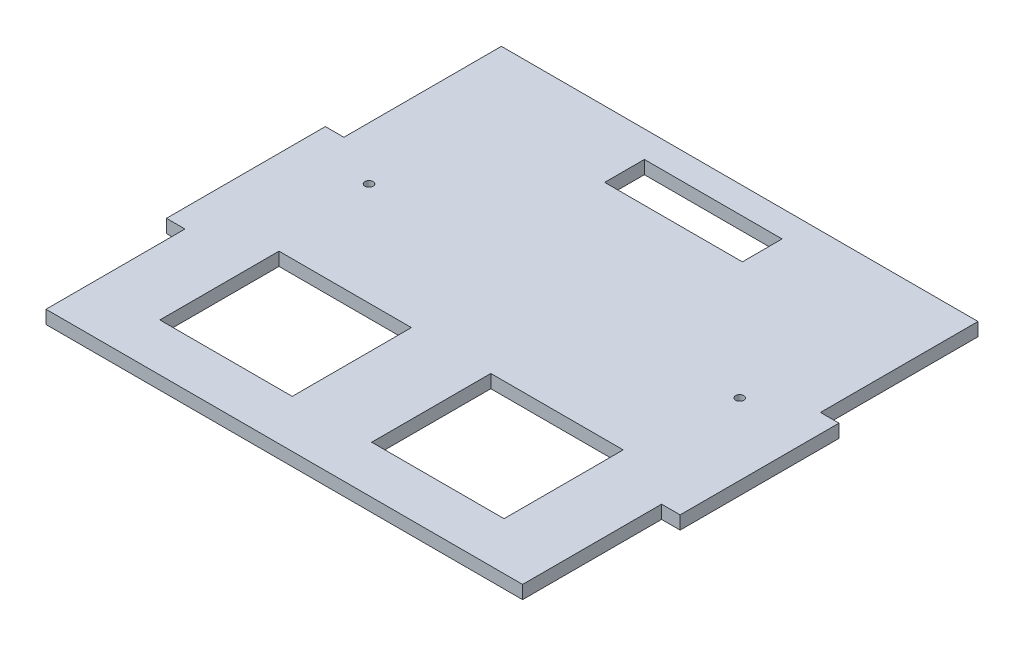
ISO-10303-21;
HEADER;
FILE_DESCRIPTION(('STEP AP214'),'2;1');
FILE_NAME('part.step','',(''),(''),'','','');
FILE_SCHEMA(('AUTOMOTIVE_DESIGN { 1 0 10303 214 1 1 1 1 }'));
ENDSEC;
DATA;
#1=APPLICATION_CONTEXT('core data for automotive mechanical design processes');
#2=APPLICATION_PROTOCOL_DEFINITION('international standard','automotive_design',2000,#1);
#3=PRODUCT_CONTEXT('',#1,'mechanical');
#4=PRODUCT('Part','Part','',(#3));
#5=PRODUCT_RELATED_PRODUCT_CATEGORY('part','',(#4));
#6=PRODUCT_DEFINITION_FORMATION('','',#4);
#7=PRODUCT_DEFINITION_CONTEXT('part definition',#1,'design');
#8=PRODUCT_DEFINITION('design','',#6,#7);
#9=PRODUCT_DEFINITION_SHAPE('','',#8);
#10=(LENGTH_UNIT() NAMED_UNIT(*) SI_UNIT(.MILLI.,.METRE.));
#11=(NAMED_UNIT(*) PLANE_ANGLE_UNIT() SI_UNIT($,.RADIAN.));
#12=(NAMED_UNIT(*) SI_UNIT($,.STERADIAN.) SOLID_ANGLE_UNIT());
#13=UNCERTAINTY_MEASURE_WITH_UNIT(LENGTH_MEASURE(1.E-05),#10,'distance_accuracy_value','');
#14=(GEOMETRIC_REPRESENTATION_CONTEXT(3) GLOBAL_UNCERTAINTY_ASSIGNED_CONTEXT((#13)) GLOBAL_UNIT_ASSIGNED_CONTEXT((#10,
#11,#12)) REPRESENTATION_CONTEXT('',''));
#15=CARTESIAN_POINT('',(0.,0.,0.));
#16=DIRECTION('',(0.,0.,1.));
#17=DIRECTION('',(1.,0.,0.));
#18=AXIS2_PLACEMENT_3D('',#15,#16,#17);
#19=CARTESIAN_POINT('',(0.,5.,0.));
#20=DIRECTION('',(0.,1.,0.));
#21=DIRECTION('',(0.,0.,1.));
#22=AXIS2_PLACEMENT_3D('',#19,#20,#21);
#23=PLANE('',#22);
#24=DIRECTION('',(1.,0.,0.));
#25=VECTOR('',#24,1.);
#26=CARTESIAN_POINT('',(15.,5.,64.5));
#27=LINE('',#26,#25);
#28=CARTESIAN_POINT('',(15.,5.,64.5));
#29=VERTEX_POINT('',#28);
#30=CARTESIAN_POINT('',(65.,5.,64.5));
#31=VERTEX_POINT('',#30);
#32=EDGE_CURVE('E206',#29,#31,#27,.T.);
#33=ORIENTED_EDGE('',*,*,#32,.F.);
#34=DIRECTION('',(0.,0.,1.));
#35=VECTOR('',#34,1.);
#36=CARTESIAN_POINT('',(15.,5.,64.5));
#37=LINE('',#36,#35);
#38=CARTESIAN_POINT('',(15.,5.,19.5));
#39=VERTEX_POINT('',#38);
#40=EDGE_CURVE('E198',#39,#29,#37,.T.);
#41=ORIENTED_EDGE('',*,*,#40,.F.);
#42=DIRECTION('',(-1.,0.,0.));
#43=VECTOR('',#42,1.);
#44=CARTESIAN_POINT('',(15.,5.,19.5));
#45=LINE('',#44,#43);
#46=CARTESIAN_POINT('',(65.,5.,19.5));
#47=VERTEX_POINT('',#46);
#48=EDGE_CURVE('E221',#47,#39,#45,.T.);
#49=ORIENTED_EDGE('',*,*,#48,.F.);
#50=DIRECTION('',(0.,0.,-1.));
#51=VECTOR('',#50,1.);
#52=CARTESIAN_POINT('',(65.,5.,64.5));
#53=LINE('',#52,#51);
#54=EDGE_CURVE('E219',#31,#47,#53,.T.);
#55=ORIENTED_EDGE('',*,*,#54,.F.);
#56=EDGE_LOOP('',(#33,#41,#49,#55));
#57=FACE_BOUND('',#56,.T.);
#58=CARTESIAN_POINT('',(70.,5.,-19.5));
#59=DIRECTION('',(0.,1.,0.));
#60=DIRECTION('',(0.,0.,1.));
#61=AXIS2_PLACEMENT_3D('',#58,#59,#60);
#62=CIRCLE('',#61,1.54999999999999);
#63=CARTESIAN_POINT('',(70.,5.,-17.95));
#64=VERTEX_POINT('',#63);
#65=EDGE_CURVE('E237',#64,#64,#62,.T.);
#66=ORIENTED_EDGE('',*,*,#65,.F.);
#67=EDGE_LOOP('',(#66));
#68=FACE_BOUND('',#67,.T.);
#69=DIRECTION('',(0.,0.,-1.));
#70=VECTOR('',#69,1.);
#71=CARTESIAN_POINT('',(90.,5.,-89.5));
#72=LINE('',#71,#70);
#73=CARTESIAN_POINT('',(90.,5.,-30.0000000000001));
#74=VERTEX_POINT('',#73);
#75=CARTESIAN_POINT('',(90.,5.,-89.5));
#76=VERTEX_POINT('',#75);
#77=EDGE_CURVE('E305',#74,#76,#72,.T.);
#78=ORIENTED_EDGE('',*,*,#77,.T.);
#79=DIRECTION('',(-1.,0.,0.));
#80=VECTOR('',#79,1.);
#81=CARTESIAN_POINT('',(-90.,5.,-89.5));
#82=LINE('',#81,#80);
#83=CARTESIAN_POINT('',(-90.,5.,-89.5));
#84=VERTEX_POINT('',#83);
#85=EDGE_CURVE('E308',#76,#84,#82,.T.);
#86=ORIENTED_EDGE('',*,*,#85,.T.);
#87=DIRECTION('',(0.,0.,1.));
#88=VECTOR('',#87,1.);
#89=CARTESIAN_POINT('',(-90.,5.,-89.5));
#90=LINE('',#89,#88);
#91=CARTESIAN_POINT('',(-90.,5.,-30.0000000000001));
#92=VERTEX_POINT('',#91);
#93=EDGE_CURVE('E311',#84,#92,#90,.T.);
#94=ORIENTED_EDGE('',*,*,#93,.T.);
#95=DIRECTION('',(-1.,0.,0.));
#96=VECTOR('',#95,1.);
#97=CARTESIAN_POINT('',(-90.,5.,-30.0000000000001));
#98=LINE('',#97,#96);
#99=CARTESIAN_POINT('',(-97.,5.,-30.));
#100=VERTEX_POINT('',#99);
#101=EDGE_CURVE('E313',#92,#100,#98,.T.);
#102=ORIENTED_EDGE('',*,*,#101,.T.);
#103=DIRECTION('',(0.,0.,1.));
#104=VECTOR('',#103,1.);
#105=CARTESIAN_POINT('',(-97.,5.,-30.));
#106=LINE('',#105,#104);
#107=CARTESIAN_POINT('',(-97.,5.,30.));
#108=VERTEX_POINT('',#107);
#109=EDGE_CURVE('E315',#100,#108,#106,.T.);
#110=ORIENTED_EDGE('',*,*,#109,.T.);
#111=DIRECTION('',(1.,0.,0.));
#112=VECTOR('',#111,1.);
#113=CARTESIAN_POINT('',(-97.,5.,30.));
#114=LINE('',#113,#112);
#115=CARTESIAN_POINT('',(-90.,5.,30.));
#116=VERTEX_POINT('',#115);
#117=EDGE_CURVE('E317',#108,#116,#114,.T.);
#118=ORIENTED_EDGE('',*,*,#117,.T.);
#119=DIRECTION('',(0.,0.,1.));
#120=VECTOR('',#119,1.);
#121=CARTESIAN_POINT('',(-90.,5.,82.5));
#122=LINE('',#121,#120);
#123=CARTESIAN_POINT('',(-90.,5.,82.5));
#124=VERTEX_POINT('',#123);
#125=EDGE_CURVE('E319',#116,#124,#122,.T.);
#126=ORIENTED_EDGE('',*,*,#125,.T.);
#127=DIRECTION('',(1.,0.,0.));
#128=VECTOR('',#127,1.);
#129=CARTESIAN_POINT('',(-90.,5.,82.5));
#130=LINE('',#129,#128);
#131=CARTESIAN_POINT('',(90.,5.,82.5));
#132=VERTEX_POINT('',#131);
#133=EDGE_CURVE('E321',#124,#132,#130,.T.);
#134=ORIENTED_EDGE('',*,*,#133,.T.);
#135=DIRECTION('',(0.,0.,-1.));
#136=VECTOR('',#135,1.);
#137=CARTESIAN_POINT('',(90.,5.,82.5));
#138=LINE('',#137,#136);
#139=CARTESIAN_POINT('',(90.,5.,30.));
#140=VERTEX_POINT('',#139);
#141=EDGE_CURVE('E323',#132,#140,#138,.T.);
#142=ORIENTED_EDGE('',*,*,#141,.T.);
#143=DIRECTION('',(1.,0.,0.));
#144=VECTOR('',#143,1.);
#145=CARTESIAN_POINT('',(97.,5.,30.));
#146=LINE('',#145,#144);
#147=CARTESIAN_POINT('',(97.,5.,30.));
#148=VERTEX_POINT('',#147);
#149=EDGE_CURVE('E325',#140,#148,#146,.T.);
#150=ORIENTED_EDGE('',*,*,#149,.T.);
#151=DIRECTION('',(0.,0.,-1.));
#152=VECTOR('',#151,1.);
#153=CARTESIAN_POINT('',(97.,5.,-30.));
#154=LINE('',#153,#152);
#155=CARTESIAN_POINT('',(97.,5.,-30.));
#156=VERTEX_POINT('',#155);
#157=EDGE_CURVE('E327',#148,#156,#154,.T.);
#158=ORIENTED_EDGE('',*,*,#157,.T.);
#159=DIRECTION('',(-1.,0.,0.));
#160=VECTOR('',#159,1.);
#161=CARTESIAN_POINT('',(90.,5.,-30.0000000000001));
#162=LINE('',#161,#160);
#163=EDGE_CURVE('E329',#156,#74,#162,.T.);
#164=ORIENTED_EDGE('',*,*,#163,.T.);
#165=EDGE_LOOP('',(#78,#86,#94,#102,#110,#118,#126,#134,#142,#150,#158,#164));
#166=FACE_BOUND('',#165,.T.);
#167=DIRECTION('',(-1.,0.,0.));
#168=VECTOR('',#167,1.);
#169=CARTESIAN_POINT('',(-26.,5.,-79.5));
#170=LINE('',#169,#168);
#171=CARTESIAN_POINT('',(26.,5.,-79.5));
#172=VERTEX_POINT('',#171);
#173=CARTESIAN_POINT('',(-26.,5.,-79.5));
#174=VERTEX_POINT('',#173);
#175=EDGE_CURVE('E276',#172,#174,#170,.T.);
#176=ORIENTED_EDGE('',*,*,#175,.F.);
#177=DIRECTION('',(0.,0.,-1.));
#178=VECTOR('',#177,1.);
#179=CARTESIAN_POINT('',(26.,5.,-64.5));
#180=LINE('',#179,#178);
#181=CARTESIAN_POINT('',(26.,5.,-64.5));
#182=VERTEX_POINT('',#181);
#183=EDGE_CURVE('E274',#182,#172,#180,.T.);
#184=ORIENTED_EDGE('',*,*,#183,.F.);
#185=DIRECTION('',(1.,0.,0.));
#186=VECTOR('',#185,1.);
#187=CARTESIAN_POINT('',(-26.,5.,-64.5));
#188=LINE('',#187,#186);
#189=CARTESIAN_POINT('',(-26.,5.,-64.5));
#190=VERTEX_POINT('',#189);
#191=EDGE_CURVE('E282',#190,#182,#188,.T.);
#192=ORIENTED_EDGE('',*,*,#191,.F.);
#193=DIRECTION('',(0.,0.,1.));
#194=VECTOR('',#193,1.);
#195=CARTESIAN_POINT('',(-26.,5.,-64.5));
#196=LINE('',#195,#194);
#197=EDGE_CURVE('E279',#174,#190,#196,.T.);
#198=ORIENTED_EDGE('',*,*,#197,.F.);
#199=EDGE_LOOP('',(#176,#184,#192,#198));
#200=FACE_BOUND('',#199,.T.);
#201=DIRECTION('',(1.,0.,0.));
#202=VECTOR('',#201,1.);
#203=CARTESIAN_POINT('',(-15.,5.,64.5));
#204=LINE('',#203,#202);
#205=CARTESIAN_POINT('',(-65.,5.,64.5));
#206=VERTEX_POINT('',#205);
#207=CARTESIAN_POINT('',(-15.,5.,64.5));
#208=VERTEX_POINT('',#207);
#209=EDGE_CURVE('E245',#206,#208,#204,.T.);
#210=ORIENTED_EDGE('',*,*,#209,.F.);
#211=DIRECTION('',(0.,0.,1.));
#212=VECTOR('',#211,1.);
#213=CARTESIAN_POINT('',(-65.,5.,64.5));
#214=LINE('',#213,#212);
#215=CARTESIAN_POINT('',(-65.,5.,19.5));
#216=VERTEX_POINT('',#215);
#217=EDGE_CURVE('E243',#216,#206,#214,.T.);
#218=ORIENTED_EDGE('',*,*,#217,.F.);
#219=DIRECTION('',(-1.,0.,0.));
#220=VECTOR('',#219,1.);
#221=CARTESIAN_POINT('',(-15.,5.,19.5));
#222=LINE('',#221,#220);
#223=CARTESIAN_POINT('',(-15.,5.,19.5));
#224=VERTEX_POINT('',#223);
#225=EDGE_CURVE('E251',#224,#216,#222,.T.);
#226=ORIENTED_EDGE('',*,*,#225,.F.);
#227=DIRECTION('',(0.,0.,-1.));
#228=VECTOR('',#227,1.);
#229=CARTESIAN_POINT('',(-15.,5.,64.5));
#230=LINE('',#229,#228);
#231=EDGE_CURVE('E248',#208,#224,#230,.T.);
#232=ORIENTED_EDGE('',*,*,#231,.F.);
#233=EDGE_LOOP('',(#210,#218,#226,#232));
#234=FACE_BOUND('',#233,.T.);
#235=CARTESIAN_POINT('',(-70.,5.,-19.5));
#236=DIRECTION('',(0.,1.,0.));
#237=DIRECTION('',(0.,0.,-1.));
#238=AXIS2_PLACEMENT_3D('',#235,#236,#237);
#239=CIRCLE('',#238,1.54999999999999);
#240=CARTESIAN_POINT('',(-70.,5.,-21.05));
#241=VERTEX_POINT('',#240);
#242=EDGE_CURVE('E227',#241,#241,#239,.T.);
#243=ORIENTED_EDGE('',*,*,#242,.F.);
#244=EDGE_LOOP('',(#243));
#245=FACE_BOUND('',#244,.T.);
#246=ADVANCED_FACE('F37',(#57,#68,#166,#200,#234,#245),#23,.T.);
#247=CARTESIAN_POINT('',(0.,0.,0.));
#248=DIRECTION('',(0.,1.,0.));
#249=DIRECTION('',(0.,0.,1.));
#250=AXIS2_PLACEMENT_3D('',#247,#248,#249);
#251=PLANE('',#250);
#252=CARTESIAN_POINT('',(70.,0.,-19.5));
#253=DIRECTION('',(0.,1.,0.));
#254=DIRECTION('',(0.,0.,1.));
#255=AXIS2_PLACEMENT_3D('',#252,#253,#254);
#256=CIRCLE('',#255,1.54999999999999);
#257=CARTESIAN_POINT('',(70.,0.,-17.95));
#258=VERTEX_POINT('',#257);
#259=EDGE_CURVE('E214',#258,#258,#256,.T.);
#260=ORIENTED_EDGE('',*,*,#259,.T.);
#261=EDGE_LOOP('',(#260));
#262=FACE_BOUND('',#261,.T.);
#263=DIRECTION('',(0.,0.,1.));
#264=VECTOR('',#263,1.);
#265=CARTESIAN_POINT('',(-65.,0.,64.5));
#266=LINE('',#265,#264);
#267=CARTESIAN_POINT('',(-65.,0.,19.5));
#268=VERTEX_POINT('',#267);
#269=CARTESIAN_POINT('',(-65.,0.,64.5));
#270=VERTEX_POINT('',#269);
#271=EDGE_CURVE('E240',#268,#270,#266,.T.);
#272=ORIENTED_EDGE('',*,*,#271,.T.);
#273=DIRECTION('',(1.,0.,0.));
#274=VECTOR('',#273,1.);
#275=CARTESIAN_POINT('',(-15.,0.,64.5));
#276=LINE('',#275,#274);
#277=CARTESIAN_POINT('',(-15.,0.,64.5));
#278=VERTEX_POINT('',#277);
#279=EDGE_CURVE('E256',#270,#278,#276,.T.);
#280=ORIENTED_EDGE('',*,*,#279,.T.);
#281=DIRECTION('',(0.,0.,-1.));
#282=VECTOR('',#281,1.);
#283=CARTESIAN_POINT('',(-15.,0.,64.5));
#284=LINE('',#283,#282);
#285=CARTESIAN_POINT('',(-15.,0.,19.5));
#286=VERTEX_POINT('',#285);
#287=EDGE_CURVE('E259',#278,#286,#284,.T.);
#288=ORIENTED_EDGE('',*,*,#287,.T.);
#289=DIRECTION('',(-1.,0.,0.));
#290=VECTOR('',#289,1.);
#291=CARTESIAN_POINT('',(-15.,0.,19.5));
#292=LINE('',#291,#290);
#293=EDGE_CURVE('E246',#286,#268,#292,.T.);
#294=ORIENTED_EDGE('',*,*,#293,.T.);
#295=EDGE_LOOP('',(#272,#280,#288,#294));
#296=FACE_BOUND('',#295,.T.);
#297=DIRECTION('',(0.,0.,-1.));
#298=VECTOR('',#297,1.);
#299=CARTESIAN_POINT('',(90.,0.,-89.5));
#300=LINE('',#299,#298);
#301=CARTESIAN_POINT('',(90.,0.,-30.0000000000001));
#302=VERTEX_POINT('',#301);
#303=CARTESIAN_POINT('',(90.,0.,-89.5));
#304=VERTEX_POINT('',#303);
#305=EDGE_CURVE('E304',#302,#304,#300,.T.);
#306=ORIENTED_EDGE('',*,*,#305,.F.);
#307=DIRECTION('',(-1.,0.,0.));
#308=VECTOR('',#307,1.);
#309=CARTESIAN_POINT('',(90.,0.,-30.0000000000001));
#310=LINE('',#309,#308);
#311=CARTESIAN_POINT('',(97.,0.,-30.));
#312=VERTEX_POINT('',#311);
#313=EDGE_CURVE('E309',#312,#302,#310,.T.);
#314=ORIENTED_EDGE('',*,*,#313,.F.);
#315=DIRECTION('',(0.,0.,-1.));
#316=VECTOR('',#315,1.);
#317=CARTESIAN_POINT('',(97.,0.,-30.));
#318=LINE('',#317,#316);
#319=CARTESIAN_POINT('',(97.,0.,30.));
#320=VERTEX_POINT('',#319);
#321=EDGE_CURVE('E352',#320,#312,#318,.T.);
#322=ORIENTED_EDGE('',*,*,#321,.F.);
#323=DIRECTION('',(1.,0.,0.));
#324=VECTOR('',#323,1.);
#325=CARTESIAN_POINT('',(97.,0.,30.));
#326=LINE('',#325,#324);
#327=CARTESIAN_POINT('',(90.,0.,30.));
#328=VERTEX_POINT('',#327);
#329=EDGE_CURVE('E350',#328,#320,#326,.T.);
#330=ORIENTED_EDGE('',*,*,#329,.F.);
#331=DIRECTION('',(0.,0.,-1.));
#332=VECTOR('',#331,1.);
#333=CARTESIAN_POINT('',(90.,0.,82.5));
#334=LINE('',#333,#332);
#335=CARTESIAN_POINT('',(90.,0.,82.5));
#336=VERTEX_POINT('',#335);
#337=EDGE_CURVE('E348',#336,#328,#334,.T.);
#338=ORIENTED_EDGE('',*,*,#337,.F.);
#339=DIRECTION('',(1.,0.,0.));
#340=VECTOR('',#339,1.);
#341=CARTESIAN_POINT('',(-90.,0.,82.5));
#342=LINE('',#341,#340);
#343=CARTESIAN_POINT('',(-90.,0.,82.5));
#344=VERTEX_POINT('',#343);
#345=EDGE_CURVE('E346',#344,#336,#342,.T.);
#346=ORIENTED_EDGE('',*,*,#345,.F.);
#347=DIRECTION('',(0.,0.,1.));
#348=VECTOR('',#347,1.);
#349=CARTESIAN_POINT('',(-90.,0.,82.5));
#350=LINE('',#349,#348);
#351=CARTESIAN_POINT('',(-90.,0.,30.));
#352=VERTEX_POINT('',#351);
#353=EDGE_CURVE('E344',#352,#344,#350,.T.);
#354=ORIENTED_EDGE('',*,*,#353,.F.);
#355=DIRECTION('',(1.,0.,0.));
#356=VECTOR('',#355,1.);
#357=CARTESIAN_POINT('',(-97.,0.,30.));
#358=LINE('',#357,#356);
#359=CARTESIAN_POINT('',(-97.,0.,30.));
#360=VERTEX_POINT('',#359);
#361=EDGE_CURVE('E342',#360,#352,#358,.T.);
#362=ORIENTED_EDGE('',*,*,#361,.F.);
#363=DIRECTION('',(0.,0.,1.));
#364=VECTOR('',#363,1.);
#365=CARTESIAN_POINT('',(-97.,0.,-30.));
#366=LINE('',#365,#364);
#367=CARTESIAN_POINT('',(-97.,0.,-30.));
#368=VERTEX_POINT('',#367);
#369=EDGE_CURVE('E340',#368,#360,#366,.T.);
#370=ORIENTED_EDGE('',*,*,#369,.F.);
#371=DIRECTION('',(-1.,0.,0.));
#372=VECTOR('',#371,1.);
#373=CARTESIAN_POINT('',(-90.,0.,-30.0000000000001));
#374=LINE('',#373,#372);
#375=CARTESIAN_POINT('',(-90.,0.,-30.0000000000001));
#376=VERTEX_POINT('',#375);
#377=EDGE_CURVE('E338',#376,#368,#374,.T.);
#378=ORIENTED_EDGE('',*,*,#377,.F.);
#379=DIRECTION('',(0.,0.,1.));
#380=VECTOR('',#379,1.);
#381=CARTESIAN_POINT('',(-90.,0.,-89.5));
#382=LINE('',#381,#380);
#383=CARTESIAN_POINT('',(-90.,0.,-89.5));
#384=VERTEX_POINT('',#383);
#385=EDGE_CURVE('E336',#384,#376,#382,.T.);
#386=ORIENTED_EDGE('',*,*,#385,.F.);
#387=DIRECTION('',(-1.,0.,0.));
#388=VECTOR('',#387,1.);
#389=CARTESIAN_POINT('',(-90.,0.,-89.5));
#390=LINE('',#389,#388);
#391=EDGE_CURVE('E334',#304,#384,#390,.T.);
#392=ORIENTED_EDGE('',*,*,#391,.F.);
#393=EDGE_LOOP('',(#306,#314,#322,#330,#338,#346,#354,#362,#370,#378,#386,#392));
#394=FACE_BOUND('',#393,.T.);
#395=DIRECTION('',(0.,0.,-1.));
#396=VECTOR('',#395,1.);
#397=CARTESIAN_POINT('',(26.,0.,-64.5));
#398=LINE('',#397,#396);
#399=CARTESIAN_POINT('',(26.,0.,-64.5));
#400=VERTEX_POINT('',#399);
#401=CARTESIAN_POINT('',(26.,0.,-79.5));
#402=VERTEX_POINT('',#401);
#403=EDGE_CURVE('E273',#400,#402,#398,.T.);
#404=ORIENTED_EDGE('',*,*,#403,.T.);
#405=DIRECTION('',(-1.,0.,0.));
#406=VECTOR('',#405,1.);
#407=CARTESIAN_POINT('',(-26.,0.,-79.5));
#408=LINE('',#407,#406);
#409=CARTESIAN_POINT('',(-26.,0.,-79.5));
#410=VERTEX_POINT('',#409);
#411=EDGE_CURVE('E287',#402,#410,#408,.T.);
#412=ORIENTED_EDGE('',*,*,#411,.T.);
#413=DIRECTION('',(0.,0.,1.));
#414=VECTOR('',#413,1.);
#415=CARTESIAN_POINT('',(-26.,0.,-64.5));
#416=LINE('',#415,#414);
#417=CARTESIAN_POINT('',(-26.,0.,-64.5));
#418=VERTEX_POINT('',#417);
#419=EDGE_CURVE('E290',#410,#418,#416,.T.);
#420=ORIENTED_EDGE('',*,*,#419,.T.);
#421=DIRECTION('',(1.,0.,0.));
#422=VECTOR('',#421,1.);
#423=CARTESIAN_POINT('',(-26.,0.,-64.5));
#424=LINE('',#423,#422);
#425=EDGE_CURVE('E277',#418,#400,#424,.T.);
#426=ORIENTED_EDGE('',*,*,#425,.T.);
#427=EDGE_LOOP('',(#404,#412,#420,#426));
#428=FACE_BOUND('',#427,.T.);
#429=DIRECTION('',(0.,0.,1.));
#430=VECTOR('',#429,1.);
#431=CARTESIAN_POINT('',(15.,0.,64.5));
#432=LINE('',#431,#430);
#433=CARTESIAN_POINT('',(15.,0.,19.5));
#434=VERTEX_POINT('',#433);
#435=CARTESIAN_POINT('',(15.,0.,64.5));
#436=VERTEX_POINT('',#435);
#437=EDGE_CURVE('E60',#434,#436,#432,.T.);
#438=ORIENTED_EDGE('',*,*,#437,.T.);
#439=DIRECTION('',(1.,0.,0.));
#440=VECTOR('',#439,1.);
#441=CARTESIAN_POINT('',(15.,0.,64.5));
#442=LINE('',#441,#440);
#443=CARTESIAN_POINT('',(65.,0.,64.5));
#444=VERTEX_POINT('',#443);
#445=EDGE_CURVE('E213',#436,#444,#442,.T.);
#446=ORIENTED_EDGE('',*,*,#445,.T.);
#447=DIRECTION('',(0.,0.,-1.));
#448=VECTOR('',#447,1.);
#449=CARTESIAN_POINT('',(65.,0.,64.5));
#450=LINE('',#449,#448);
#451=CARTESIAN_POINT('',(65.,0.,19.5));
#452=VERTEX_POINT('',#451);
#453=EDGE_CURVE('E229',#444,#452,#450,.T.);
#454=ORIENTED_EDGE('',*,*,#453,.T.);
#455=DIRECTION('',(-1.,0.,0.));
#456=VECTOR('',#455,1.);
#457=CARTESIAN_POINT('',(15.,0.,19.5));
#458=LINE('',#457,#456);
#459=EDGE_CURVE('E207',#452,#434,#458,.T.);
#460=ORIENTED_EDGE('',*,*,#459,.T.);
#461=EDGE_LOOP('',(#438,#446,#454,#460));
#462=FACE_BOUND('',#461,.T.);
#463=CARTESIAN_POINT('',(-70.,0.,-19.5));
#464=DIRECTION('',(0.,1.,0.));
#465=DIRECTION('',(0.,0.,-1.));
#466=AXIS2_PLACEMENT_3D('',#463,#464,#465);
#467=CIRCLE('',#466,1.54999999999999);
#468=CARTESIAN_POINT('',(-70.,0.,-21.05));
#469=VERTEX_POINT('',#468);
#470=EDGE_CURVE('E697',#469,#469,#467,.T.);
#471=ORIENTED_EDGE('',*,*,#470,.T.);
#472=EDGE_LOOP('',(#471));
#473=FACE_BOUND('',#472,.T.);
#474=ADVANCED_FACE('F394',(#262,#296,#394,#428,#462,#473),#251,.F.);
#475=CARTESIAN_POINT('',(90.,5.,-89.5));
#476=DIRECTION('',(-1.,0.,0.));
#477=DIRECTION('',(0.,0.,1.));
#478=AXIS2_PLACEMENT_3D('',#475,#476,#477);
#479=PLANE('',#478);
#480=ORIENTED_EDGE('',*,*,#305,.T.);
#481=DIRECTION('',(0.,-1.,0.));
#482=VECTOR('',#481,1.);
#483=CARTESIAN_POINT('',(90.,5.,-89.5));
#484=LINE('',#483,#482);
#485=EDGE_CURVE('E11',#76,#304,#484,.T.);
#486=ORIENTED_EDGE('',*,*,#485,.F.);
#487=ORIENTED_EDGE('',*,*,#77,.F.);
#488=DIRECTION('',(0.,-1.,0.));
#489=VECTOR('',#488,1.);
#490=CARTESIAN_POINT('',(90.,5.,-30.0000000000001));
#491=LINE('',#490,#489);
#492=EDGE_CURVE('E331',#74,#302,#491,.T.);
#493=ORIENTED_EDGE('',*,*,#492,.T.);
#494=EDGE_LOOP('',(#480,#486,#487,#493));
#495=FACE_BOUND('',#494,.T.);
#496=ADVANCED_FACE('F39',(#495),#479,.F.);
#497=CARTESIAN_POINT('',(-90.,5.,-89.5));
#498=DIRECTION('',(0.,0.,1.));
#499=DIRECTION('',(1.,0.,0.));
#500=AXIS2_PLACEMENT_3D('',#497,#498,#499);
#501=PLANE('',#500);
#502=ORIENTED_EDGE('',*,*,#391,.T.);
#503=DIRECTION('',(0.,-1.,0.));
#504=VECTOR('',#503,1.);
#505=CARTESIAN_POINT('',(-90.,5.,-89.5));
#506=LINE('',#505,#504);
#507=EDGE_CURVE('E45',#84,#384,#506,.T.);
#508=ORIENTED_EDGE('',*,*,#507,.F.);
#509=ORIENTED_EDGE('',*,*,#85,.F.);
#510=ORIENTED_EDGE('',*,*,#485,.T.);
#511=EDGE_LOOP('',(#502,#508,#509,#510));
#512=FACE_BOUND('',#511,.T.);
#513=ADVANCED_FACE('F412',(#512),#501,.F.);
#514=CARTESIAN_POINT('',(-90.,5.,-89.5));
#515=DIRECTION('',(1.,0.,0.));
#516=DIRECTION('',(0.,0.,-1.));
#517=AXIS2_PLACEMENT_3D('',#514,#515,#516);
#518=PLANE('',#517);
#519=ORIENTED_EDGE('',*,*,#385,.T.);
#520=DIRECTION('',(0.,-1.,0.));
#521=VECTOR('',#520,1.);
#522=CARTESIAN_POINT('',(-90.,5.,-30.0000000000001));
#523=LINE('',#522,#521);
#524=EDGE_CURVE('E381',#92,#376,#523,.T.);
#525=ORIENTED_EDGE('',*,*,#524,.F.);
#526=ORIENTED_EDGE('',*,*,#93,.F.);
#527=ORIENTED_EDGE('',*,*,#507,.T.);
#528=EDGE_LOOP('',(#519,#525,#526,#527));
#529=FACE_BOUND('',#528,.T.);
#530=ADVANCED_FACE('F388',(#529),#518,.F.);
#531=CARTESIAN_POINT('',(-90.,5.,-30.0000000000001));
#532=DIRECTION('',(0.,0.,1.));
#533=DIRECTION('',(1.,0.,0.));
#534=AXIS2_PLACEMENT_3D('',#531,#532,#533);
#535=PLANE('',#534);
#536=ORIENTED_EDGE('',*,*,#377,.T.);
#537=DIRECTION('',(0.,-1.,0.));
#538=VECTOR('',#537,1.);
#539=CARTESIAN_POINT('',(-97.,5.,-30.));
#540=LINE('',#539,#538);
#541=EDGE_CURVE('E378',#100,#368,#540,.T.);
#542=ORIENTED_EDGE('',*,*,#541,.F.);
#543=ORIENTED_EDGE('',*,*,#101,.F.);
#544=ORIENTED_EDGE('',*,*,#524,.T.);
#545=EDGE_LOOP('',(#536,#542,#543,#544));
#546=FACE_BOUND('',#545,.T.);
#547=ADVANCED_FACE('F400',(#546),#535,.F.);
#548=CARTESIAN_POINT('',(-97.,5.,-30.));
#549=DIRECTION('',(1.,0.,0.));
#550=DIRECTION('',(0.,0.,-1.));
#551=AXIS2_PLACEMENT_3D('',#548,#549,#550);
#552=PLANE('',#551);
#553=ORIENTED_EDGE('',*,*,#369,.T.);
#554=DIRECTION('',(0.,-1.,0.));
#555=VECTOR('',#554,1.);
#556=CARTESIAN_POINT('',(-97.,5.,30.));
#557=LINE('',#556,#555);
#558=EDGE_CURVE('E375',#108,#360,#557,.T.);
#559=ORIENTED_EDGE('',*,*,#558,.F.);
#560=ORIENTED_EDGE('',*,*,#109,.F.);
#561=ORIENTED_EDGE('',*,*,#541,.T.);
#562=EDGE_LOOP('',(#553,#559,#560,#561));
#563=FACE_BOUND('',#562,.T.);
#564=ADVANCED_FACE('F404',(#563),#552,.F.);
#565=CARTESIAN_POINT('',(-97.,5.,30.));
#566=DIRECTION('',(0.,0.,-1.));
#567=DIRECTION('',(-1.,0.,0.));
#568=AXIS2_PLACEMENT_3D('',#565,#566,#567);
#569=PLANE('',#568);
#570=ORIENTED_EDGE('',*,*,#361,.T.);
#571=DIRECTION('',(0.,-1.,0.));
#572=VECTOR('',#571,1.);
#573=CARTESIAN_POINT('',(-90.,5.,30.));
#574=LINE('',#573,#572);
#575=EDGE_CURVE('E372',#116,#352,#574,.T.);
#576=ORIENTED_EDGE('',*,*,#575,.F.);
#577=ORIENTED_EDGE('',*,*,#117,.F.);
#578=ORIENTED_EDGE('',*,*,#558,.T.);
#579=EDGE_LOOP('',(#570,#576,#577,#578));
#580=FACE_BOUND('',#579,.T.);
#581=ADVANCED_FACE('F445',(#580),#569,.F.);
#582=CARTESIAN_POINT('',(-90.,5.,82.5));
#583=DIRECTION('',(1.,0.,0.));
#584=DIRECTION('',(0.,0.,-1.));
#585=AXIS2_PLACEMENT_3D('',#582,#583,#584);
#586=PLANE('',#585);
#587=ORIENTED_EDGE('',*,*,#353,.T.);
#588=DIRECTION('',(0.,-1.,0.));
#589=VECTOR('',#588,1.);
#590=CARTESIAN_POINT('',(-90.,5.,82.5));
#591=LINE('',#590,#589);
#592=EDGE_CURVE('E369',#124,#344,#591,.T.);
#593=ORIENTED_EDGE('',*,*,#592,.F.);
#594=ORIENTED_EDGE('',*,*,#125,.F.);
#595=ORIENTED_EDGE('',*,*,#575,.T.);
#596=EDGE_LOOP('',(#587,#593,#594,#595));
#597=FACE_BOUND('',#596,.T.);
#598=ADVANCED_FACE('F443',(#597),#586,.F.);
#599=CARTESIAN_POINT('',(-90.,5.,82.5));
#600=DIRECTION('',(0.,0.,-1.));
#601=DIRECTION('',(-1.,0.,0.));
#602=AXIS2_PLACEMENT_3D('',#599,#600,#601);
#603=PLANE('',#602);
#604=ORIENTED_EDGE('',*,*,#345,.T.);
#605=DIRECTION('',(0.,-1.,0.));
#606=VECTOR('',#605,1.);
#607=CARTESIAN_POINT('',(90.,5.,82.5));
#608=LINE('',#607,#606);
#609=EDGE_CURVE('E366',#132,#336,#608,.T.);
#610=ORIENTED_EDGE('',*,*,#609,.F.);
#611=ORIENTED_EDGE('',*,*,#133,.F.);
#612=ORIENTED_EDGE('',*,*,#592,.T.);
#613=EDGE_LOOP('',(#604,#610,#611,#612));
#614=FACE_BOUND('',#613,.T.);
#615=ADVANCED_FACE('F439',(#614),#603,.F.);
#616=CARTESIAN_POINT('',(90.,5.,82.5));
#617=DIRECTION('',(-1.,0.,0.));
#618=DIRECTION('',(0.,0.,1.));
#619=AXIS2_PLACEMENT_3D('',#616,#617,#618);
#620=PLANE('',#619);
#621=ORIENTED_EDGE('',*,*,#337,.T.);
#622=DIRECTION('',(0.,-1.,0.));
#623=VECTOR('',#622,1.);
#624=CARTESIAN_POINT('',(90.,5.,30.));
#625=LINE('',#624,#623);
#626=EDGE_CURVE('E363',#140,#328,#625,.T.);
#627=ORIENTED_EDGE('',*,*,#626,.F.);
#628=ORIENTED_EDGE('',*,*,#141,.F.);
#629=ORIENTED_EDGE('',*,*,#609,.T.);
#630=EDGE_LOOP('',(#621,#627,#628,#629));
#631=FACE_BOUND('',#630,.T.);
#632=ADVANCED_FACE('F434',(#631),#620,.F.);
#633=CARTESIAN_POINT('',(97.,5.,30.));
#634=DIRECTION('',(0.,0.,-1.));
#635=DIRECTION('',(-1.,0.,0.));
#636=AXIS2_PLACEMENT_3D('',#633,#634,#635);
#637=PLANE('',#636);
#638=ORIENTED_EDGE('',*,*,#329,.T.);
#639=DIRECTION('',(0.,-1.,0.));
#640=VECTOR('',#639,1.);
#641=CARTESIAN_POINT('',(97.,5.,30.));
#642=LINE('',#641,#640);
#643=EDGE_CURVE('E360',#148,#320,#642,.T.);
#644=ORIENTED_EDGE('',*,*,#643,.F.);
#645=ORIENTED_EDGE('',*,*,#149,.F.);
#646=ORIENTED_EDGE('',*,*,#626,.T.);
#647=EDGE_LOOP('',(#638,#644,#645,#646));
#648=FACE_BOUND('',#647,.T.);
#649=ADVANCED_FACE('F428',(#648),#637,.F.);
#650=CARTESIAN_POINT('',(97.,5.,-30.));
#651=DIRECTION('',(-1.,0.,0.));
#652=DIRECTION('',(0.,0.,1.));
#653=AXIS2_PLACEMENT_3D('',#650,#651,#652);
#654=PLANE('',#653);
#655=ORIENTED_EDGE('',*,*,#321,.T.);
#656=DIRECTION('',(0.,-1.,0.));
#657=VECTOR('',#656,1.);
#658=CARTESIAN_POINT('',(97.,5.,-30.));
#659=LINE('',#658,#657);
#660=EDGE_CURVE('E357',#156,#312,#659,.T.);
#661=ORIENTED_EDGE('',*,*,#660,.F.);
#662=ORIENTED_EDGE('',*,*,#157,.F.);
#663=ORIENTED_EDGE('',*,*,#643,.T.);
#664=EDGE_LOOP('',(#655,#661,#662,#663));
#665=FACE_BOUND('',#664,.T.);
#666=ADVANCED_FACE('F424',(#665),#654,.F.);
#667=CARTESIAN_POINT('',(90.,5.,-30.0000000000001));
#668=DIRECTION('',(0.,0.,1.));
#669=DIRECTION('',(1.,0.,0.));
#670=AXIS2_PLACEMENT_3D('',#667,#668,#669);
#671=PLANE('',#670);
#672=ORIENTED_EDGE('',*,*,#313,.T.);
#673=ORIENTED_EDGE('',*,*,#492,.F.);
#674=ORIENTED_EDGE('',*,*,#163,.F.);
#675=ORIENTED_EDGE('',*,*,#660,.T.);
#676=EDGE_LOOP('',(#672,#673,#674,#675));
#677=FACE_BOUND('',#676,.T.);
#678=ADVANCED_FACE('F419',(#677),#671,.F.);
#679=CARTESIAN_POINT('',(26.,5.,-64.5));
#680=DIRECTION('',(-1.,0.,0.));
#681=DIRECTION('',(0.,0.,1.));
#682=AXIS2_PLACEMENT_3D('',#679,#680,#681);
#683=PLANE('',#682);
#684=ORIENTED_EDGE('',*,*,#403,.F.);
#685=DIRECTION('',(0.,-1.,0.));
#686=VECTOR('',#685,1.);
#687=CARTESIAN_POINT('',(26.,5.,-64.5));
#688=LINE('',#687,#686);
#689=EDGE_CURVE('E284',#182,#400,#688,.T.);
#690=ORIENTED_EDGE('',*,*,#689,.F.);
#691=ORIENTED_EDGE('',*,*,#183,.T.);
#692=DIRECTION('',(0.,-1.,0.));
#693=VECTOR('',#692,1.);
#694=CARTESIAN_POINT('',(26.,5.,-79.5));
#695=LINE('',#694,#693);
#696=EDGE_CURVE('E301',#172,#402,#695,.T.);
#697=ORIENTED_EDGE('',*,*,#696,.T.);
#698=EDGE_LOOP('',(#684,#690,#691,#697));
#699=FACE_BOUND('',#698,.T.);
#700=ADVANCED_FACE('F462',(#699),#683,.T.);
#701=CARTESIAN_POINT('',(-26.,5.,-79.5));
#702=DIRECTION('',(0.,0.,1.));
#703=DIRECTION('',(1.,0.,0.));
#704=AXIS2_PLACEMENT_3D('',#701,#702,#703);
#705=PLANE('',#704);
#706=ORIENTED_EDGE('',*,*,#411,.F.);
#707=ORIENTED_EDGE('',*,*,#696,.F.);
#708=ORIENTED_EDGE('',*,*,#175,.T.);
#709=DIRECTION('',(0.,-1.,0.));
#710=VECTOR('',#709,1.);
#711=CARTESIAN_POINT('',(-26.,5.,-79.5));
#712=LINE('',#711,#710);
#713=EDGE_CURVE('E299',#174,#410,#712,.T.);
#714=ORIENTED_EDGE('',*,*,#713,.T.);
#715=EDGE_LOOP('',(#706,#707,#708,#714));
#716=FACE_BOUND('',#715,.T.);
#717=ADVANCED_FACE('F500',(#716),#705,.T.);
#718=CARTESIAN_POINT('',(-26.,5.,-64.5));
#719=DIRECTION('',(1.,0.,0.));
#720=DIRECTION('',(0.,0.,-1.));
#721=AXIS2_PLACEMENT_3D('',#718,#719,#720);
#722=PLANE('',#721);
#723=ORIENTED_EDGE('',*,*,#419,.F.);
#724=ORIENTED_EDGE('',*,*,#713,.F.);
#725=ORIENTED_EDGE('',*,*,#197,.T.);
#726=DIRECTION('',(0.,-1.,0.));
#727=VECTOR('',#726,1.);
#728=CARTESIAN_POINT('',(-26.,5.,-64.5));
#729=LINE('',#728,#727);
#730=EDGE_CURVE('E297',#190,#418,#729,.T.);
#731=ORIENTED_EDGE('',*,*,#730,.T.);
#732=EDGE_LOOP('',(#723,#724,#725,#731));
#733=FACE_BOUND('',#732,.T.);
#734=ADVANCED_FACE('F507',(#733),#722,.T.);
#735=CARTESIAN_POINT('',(-26.,5.,-64.5));
#736=DIRECTION('',(0.,0.,-1.));
#737=DIRECTION('',(-1.,0.,0.));
#738=AXIS2_PLACEMENT_3D('',#735,#736,#737);
#739=PLANE('',#738);
#740=ORIENTED_EDGE('',*,*,#425,.F.);
#741=ORIENTED_EDGE('',*,*,#730,.F.);
#742=ORIENTED_EDGE('',*,*,#191,.T.);
#743=ORIENTED_EDGE('',*,*,#689,.T.);
#744=EDGE_LOOP('',(#740,#741,#742,#743));
#745=FACE_BOUND('',#744,.T.);
#746=ADVANCED_FACE('F514',(#745),#739,.T.);
#747=CARTESIAN_POINT('',(-65.,5.,64.5));
#748=DIRECTION('',(1.,0.,0.));
#749=DIRECTION('',(0.,0.,-1.));
#750=AXIS2_PLACEMENT_3D('',#747,#748,#749);
#751=PLANE('',#750);
#752=ORIENTED_EDGE('',*,*,#271,.F.);
#753=DIRECTION('',(0.,-1.,0.));
#754=VECTOR('',#753,1.);
#755=CARTESIAN_POINT('',(-65.,5.,19.5));
#756=LINE('',#755,#754);
#757=EDGE_CURVE('E253',#216,#268,#756,.T.);
#758=ORIENTED_EDGE('',*,*,#757,.F.);
#759=ORIENTED_EDGE('',*,*,#217,.T.);
#760=DIRECTION('',(0.,-1.,0.));
#761=VECTOR('',#760,1.);
#762=CARTESIAN_POINT('',(-65.,5.,64.5));
#763=LINE('',#762,#761);
#764=EDGE_CURVE('E270',#206,#270,#763,.T.);
#765=ORIENTED_EDGE('',*,*,#764,.T.);
#766=EDGE_LOOP('',(#752,#758,#759,#765));
#767=FACE_BOUND('',#766,.T.);
#768=ADVANCED_FACE('F522',(#767),#751,.T.);
#769=CARTESIAN_POINT('',(-15.,5.,64.5));
#770=DIRECTION('',(0.,0.,-1.));
#771=DIRECTION('',(-1.,0.,0.));
#772=AXIS2_PLACEMENT_3D('',#769,#770,#771);
#773=PLANE('',#772);
#774=ORIENTED_EDGE('',*,*,#279,.F.);
#775=ORIENTED_EDGE('',*,*,#764,.F.);
#776=ORIENTED_EDGE('',*,*,#209,.T.);
#777=DIRECTION('',(0.,-1.,0.));
#778=VECTOR('',#777,1.);
#779=CARTESIAN_POINT('',(-15.,5.,64.5));
#780=LINE('',#779,#778);
#781=EDGE_CURVE('E268',#208,#278,#780,.T.);
#782=ORIENTED_EDGE('',*,*,#781,.T.);
#783=EDGE_LOOP('',(#774,#775,#776,#782));
#784=FACE_BOUND('',#783,.T.);
#785=ADVANCED_FACE('F530',(#784),#773,.T.);
#786=CARTESIAN_POINT('',(-15.,5.,64.5));
#787=DIRECTION('',(-1.,0.,0.));
#788=DIRECTION('',(0.,0.,1.));
#789=AXIS2_PLACEMENT_3D('',#786,#787,#788);
#790=PLANE('',#789);
#791=ORIENTED_EDGE('',*,*,#287,.F.);
#792=ORIENTED_EDGE('',*,*,#781,.F.);
#793=ORIENTED_EDGE('',*,*,#231,.T.);
#794=DIRECTION('',(0.,-1.,0.));
#795=VECTOR('',#794,1.);
#796=CARTESIAN_POINT('',(-15.,5.,19.5));
#797=LINE('',#796,#795);
#798=EDGE_CURVE('E266',#224,#286,#797,.T.);
#799=ORIENTED_EDGE('',*,*,#798,.T.);
#800=EDGE_LOOP('',(#791,#792,#793,#799));
#801=FACE_BOUND('',#800,.T.);
#802=ADVANCED_FACE('F538',(#801),#790,.T.);
#803=CARTESIAN_POINT('',(-15.,5.,19.5));
#804=DIRECTION('',(0.,0.,1.));
#805=DIRECTION('',(1.,0.,0.));
#806=AXIS2_PLACEMENT_3D('',#803,#804,#805);
#807=PLANE('',#806);
#808=ORIENTED_EDGE('',*,*,#293,.F.);
#809=ORIENTED_EDGE('',*,*,#798,.F.);
#810=ORIENTED_EDGE('',*,*,#225,.T.);
#811=ORIENTED_EDGE('',*,*,#757,.T.);
#812=EDGE_LOOP('',(#808,#809,#810,#811));
#813=FACE_BOUND('',#812,.T.);
#814=ADVANCED_FACE('F546',(#813),#807,.T.);
#815=CARTESIAN_POINT('',(70.,5.,-19.5));
#816=DIRECTION('',(0.,-1.,0.));
#817=DIRECTION('',(0.,0.,-1.));
#818=AXIS2_PLACEMENT_3D('',#815,#816,#817);
#819=CYLINDRICAL_SURFACE('',#818,1.54999999999999);
#820=ORIENTED_EDGE('',*,*,#65,.T.);
#821=EDGE_LOOP('',(#820));
#822=FACE_BOUND('',#821,.T.);
#823=ORIENTED_EDGE('',*,*,#259,.F.);
#824=EDGE_LOOP('',(#823));
#825=FACE_BOUND('',#824,.T.);
#826=ADVANCED_FACE('F554',(#822,#825),#819,.F.);
#827=CARTESIAN_POINT('',(15.,5.,64.5));
#828=DIRECTION('',(1.,0.,0.));
#829=DIRECTION('',(0.,0.,-1.));
#830=AXIS2_PLACEMENT_3D('',#827,#828,#829);
#831=PLANE('',#830);
#832=ORIENTED_EDGE('',*,*,#437,.F.);
#833=DIRECTION('',(0.,-1.,0.));
#834=VECTOR('',#833,1.);
#835=CARTESIAN_POINT('',(15.,5.,19.5));
#836=LINE('',#835,#834);
#837=EDGE_CURVE('E202',#39,#434,#836,.T.);
#838=ORIENTED_EDGE('',*,*,#837,.F.);
#839=ORIENTED_EDGE('',*,*,#40,.T.);
#840=DIRECTION('',(0.,-1.,0.));
#841=VECTOR('',#840,1.);
#842=CARTESIAN_POINT('',(15.,5.,64.5));
#843=LINE('',#842,#841);
#844=EDGE_CURVE('E201',#29,#436,#843,.T.);
#845=ORIENTED_EDGE('',*,*,#844,.T.);
#846=EDGE_LOOP('',(#832,#838,#839,#845));
#847=FACE_BOUND('',#846,.T.);
#848=ADVANCED_FACE('F200',(#847),#831,.T.);
#849=CARTESIAN_POINT('',(15.,5.,64.5));
#850=DIRECTION('',(0.,0.,-1.));
#851=DIRECTION('',(-1.,0.,0.));
#852=AXIS2_PLACEMENT_3D('',#849,#850,#851);
#853=PLANE('',#852);
#854=ORIENTED_EDGE('',*,*,#445,.F.);
#855=ORIENTED_EDGE('',*,*,#844,.F.);
#856=ORIENTED_EDGE('',*,*,#32,.T.);
#857=DIRECTION('',(0.,-1.,0.));
#858=VECTOR('',#857,1.);
#859=CARTESIAN_POINT('',(65.,5.,64.5));
#860=LINE('',#859,#858);
#861=EDGE_CURVE('E215',#31,#444,#860,.T.);
#862=ORIENTED_EDGE('',*,*,#861,.T.);
#863=EDGE_LOOP('',(#854,#855,#856,#862));
#864=FACE_BOUND('',#863,.T.);
#865=ADVANCED_FACE('F210',(#864),#853,.T.);
#866=CARTESIAN_POINT('',(65.,5.,64.5));
#867=DIRECTION('',(-1.,0.,0.));
#868=DIRECTION('',(0.,0.,1.));
#869=AXIS2_PLACEMENT_3D('',#866,#867,#868);
#870=PLANE('',#869);
#871=ORIENTED_EDGE('',*,*,#453,.F.);
#872=ORIENTED_EDGE('',*,*,#861,.F.);
#873=ORIENTED_EDGE('',*,*,#54,.T.);
#874=DIRECTION('',(0.,-1.,0.));
#875=VECTOR('',#874,1.);
#876=CARTESIAN_POINT('',(65.,5.,19.5));
#877=LINE('',#876,#875);
#878=EDGE_CURVE('E52',#47,#452,#877,.T.);
#879=ORIENTED_EDGE('',*,*,#878,.T.);
#880=EDGE_LOOP('',(#871,#872,#873,#879));
#881=FACE_BOUND('',#880,.T.);
#882=ADVANCED_FACE('F575',(#881),#870,.T.);
#883=CARTESIAN_POINT('',(15.,5.,19.5));
#884=DIRECTION('',(0.,0.,1.));
#885=DIRECTION('',(1.,0.,0.));
#886=AXIS2_PLACEMENT_3D('',#883,#884,#885);
#887=PLANE('',#886);
#888=ORIENTED_EDGE('',*,*,#459,.F.);
#889=ORIENTED_EDGE('',*,*,#878,.F.);
#890=ORIENTED_EDGE('',*,*,#48,.T.);
#891=ORIENTED_EDGE('',*,*,#837,.T.);
#892=EDGE_LOOP('',(#888,#889,#890,#891));
#893=FACE_BOUND('',#892,.T.);
#894=ADVANCED_FACE('F582',(#893),#887,.T.);
#895=CARTESIAN_POINT('',(-70.,5.,-19.5));
#896=DIRECTION('',(0.,-1.,0.));
#897=DIRECTION('',(0.,0.,-1.));
#898=AXIS2_PLACEMENT_3D('',#895,#896,#897);
#899=CYLINDRICAL_SURFACE('',#898,1.54999999999999);
#900=ORIENTED_EDGE('',*,*,#242,.T.);
#901=EDGE_LOOP('',(#900));
#902=FACE_BOUND('',#901,.T.);
#903=ORIENTED_EDGE('',*,*,#470,.F.);
#904=EDGE_LOOP('',(#903));
#905=FACE_BOUND('',#904,.T.);
#906=ADVANCED_FACE('F590',(#902,#905),#899,.F.);
#907=CLOSED_SHELL('',(#246,#474,#496,#513,#530,#547,#564,#581,#598,#615,#632,#649,#666,#678,
#700,#717,#734,#746,#768,#785,#802,#814,#826,#848,#865,#882,#894,#906));
#908=MANIFOLD_SOLID_BREP('B2',#907);
#909=ADVANCED_BREP_SHAPE_REPRESENTATION('',(#18,#908),#14);
#910=SHAPE_DEFINITION_REPRESENTATION(#9,#909);
ENDSEC;
END-ISO-10303-21;
